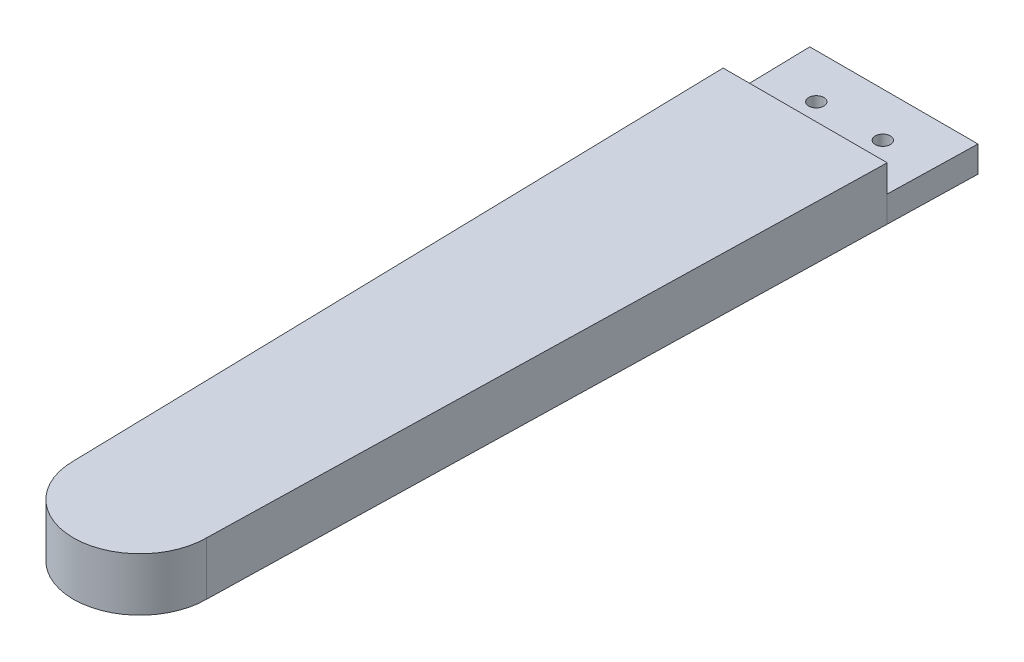
ISO-10303-21;
HEADER;
FILE_DESCRIPTION(('STEP AP214'),'2;1');
FILE_NAME('part.step','',(''),(''),'','','');
FILE_SCHEMA(('AUTOMOTIVE_DESIGN { 1 0 10303 214 1 1 1 1 }'));
ENDSEC;
DATA;
#1=APPLICATION_CONTEXT('core data for automotive mechanical design processes');
#2=APPLICATION_PROTOCOL_DEFINITION('international standard','automotive_design',2000,#1);
#3=PRODUCT_CONTEXT('',#1,'mechanical');
#4=PRODUCT('Part','Part','',(#3));
#5=PRODUCT_RELATED_PRODUCT_CATEGORY('part','',(#4));
#6=PRODUCT_DEFINITION_FORMATION('','',#4);
#7=PRODUCT_DEFINITION_CONTEXT('part definition',#1,'design');
#8=PRODUCT_DEFINITION('design','',#6,#7);
#9=PRODUCT_DEFINITION_SHAPE('','',#8);
#10=(LENGTH_UNIT() NAMED_UNIT(*) SI_UNIT(.MILLI.,.METRE.));
#11=(NAMED_UNIT(*) PLANE_ANGLE_UNIT() SI_UNIT($,.RADIAN.));
#12=(NAMED_UNIT(*) SI_UNIT($,.STERADIAN.) SOLID_ANGLE_UNIT());
#13=UNCERTAINTY_MEASURE_WITH_UNIT(LENGTH_MEASURE(1.E-05),#10,'distance_accuracy_value','');
#14=(GEOMETRIC_REPRESENTATION_CONTEXT(3) GLOBAL_UNCERTAINTY_ASSIGNED_CONTEXT((#13)) GLOBAL_UNIT_ASSIGNED_CONTEXT((#10,
#11,#12)) REPRESENTATION_CONTEXT('',''));
#15=CARTESIAN_POINT('',(0.,0.,0.));
#16=DIRECTION('',(0.,0.,1.));
#17=DIRECTION('',(1.,0.,0.));
#18=AXIS2_PLACEMENT_3D('',#15,#16,#17);
#19=CARTESIAN_POINT('',(7.5,5.9,-85.));
#20=DIRECTION('',(0.,-1.,0.));
#21=DIRECTION('',(0.,0.,-1.));
#22=AXIS2_PLACEMENT_3D('',#19,#20,#21);
#23=CYLINDRICAL_SURFACE('',#22,1.7);
#24=CARTESIAN_POINT('',(7.5,5.9,-85.));
#25=DIRECTION('',(0.,-1.,0.));
#26=DIRECTION('',(0.,0.,1.));
#27=AXIS2_PLACEMENT_3D('',#24,#25,#26);
#28=CIRCLE('',#27,1.7);
#29=CARTESIAN_POINT('',(7.5,5.9,-83.3));
#30=VERTEX_POINT('',#29);
#31=EDGE_CURVE('E277',#30,#30,#28,.T.);
#32=ORIENTED_EDGE('',*,*,#31,.F.);
#33=EDGE_LOOP('',(#32));
#34=FACE_BOUND('',#33,.T.);
#35=CARTESIAN_POINT('',(7.5,3.,-85.));
#36=DIRECTION('',(0.,-1.,0.));
#37=DIRECTION('',(0.,0.,-1.));
#38=AXIS2_PLACEMENT_3D('',#35,#36,#37);
#39=CIRCLE('',#38,1.7);
#40=CARTESIAN_POINT('',(7.5,3.,-86.7));
#41=VERTEX_POINT('',#40);
#42=EDGE_CURVE('E43',#41,#41,#39,.F.);
#43=ORIENTED_EDGE('',*,*,#42,.F.);
#44=EDGE_LOOP('',(#43));
#45=FACE_BOUND('',#44,.T.);
#46=ADVANCED_FACE('F39',(#34,#45),#23,.F.);
#47=CARTESIAN_POINT('',(-7.5,5.9,-85.));
#48=DIRECTION('',(0.,-1.,0.));
#49=DIRECTION('',(0.,0.,-1.));
#50=AXIS2_PLACEMENT_3D('',#47,#48,#49);
#51=CYLINDRICAL_SURFACE('',#50,1.7);
#52=CARTESIAN_POINT('',(-7.5,5.9,-85.));
#53=DIRECTION('',(0.,-1.,0.));
#54=DIRECTION('',(0.,0.,-1.));
#55=AXIS2_PLACEMENT_3D('',#52,#53,#54);
#56=CIRCLE('',#55,1.7);
#57=CARTESIAN_POINT('',(-7.5,5.9,-86.7));
#58=VERTEX_POINT('',#57);
#59=EDGE_CURVE('E273',#58,#58,#56,.T.);
#60=ORIENTED_EDGE('',*,*,#59,.F.);
#61=EDGE_LOOP('',(#60));
#62=FACE_BOUND('',#61,.T.);
#63=CARTESIAN_POINT('',(-7.5,3.,-85.));
#64=DIRECTION('',(0.,-1.,0.));
#65=DIRECTION('',(0.,0.,-1.));
#66=AXIS2_PLACEMENT_3D('',#63,#64,#65);
#67=CIRCLE('',#66,1.7);
#68=CARTESIAN_POINT('',(-7.5,3.,-86.7));
#69=VERTEX_POINT('',#68);
#70=EDGE_CURVE('E219',#69,#69,#67,.F.);
#71=ORIENTED_EDGE('',*,*,#70,.F.);
#72=EDGE_LOOP('',(#71));
#73=FACE_BOUND('',#72,.T.);
#74=ADVANCED_FACE('F339',(#62,#73),#51,.F.);
#75=CARTESIAN_POINT('',(0.,12.,75.));
#76=DIRECTION('',(0.,-1.,0.));
#77=DIRECTION('',(0.,0.,-1.));
#78=AXIS2_PLACEMENT_3D('',#75,#76,#77);
#79=CYLINDRICAL_SURFACE('',#78,15.);
#80=CARTESIAN_POINT('',(0.,0.,75.));
#81=DIRECTION('',(0.,1.,0.));
#82=DIRECTION('',(0.,0.,1.));
#83=AXIS2_PLACEMENT_3D('',#80,#81,#82);
#84=CIRCLE('',#83,15.);
#85=CARTESIAN_POINT('',(-15.,0.,75.));
#86=VERTEX_POINT('',#85);
#87=CARTESIAN_POINT('',(15.,0.,75.));
#88=VERTEX_POINT('',#87);
#89=EDGE_CURVE('E300',#86,#88,#84,.T.);
#90=ORIENTED_EDGE('',*,*,#89,.T.);
#91=DIRECTION('',(0.,-1.,0.));
#92=VECTOR('',#91,1.);
#93=CARTESIAN_POINT('',(15.,12.,75.));
#94=LINE('',#93,#92);
#95=CARTESIAN_POINT('',(15.,12.,75.));
#96=VERTEX_POINT('',#95);
#97=EDGE_CURVE('E11',#96,#88,#94,.T.);
#98=ORIENTED_EDGE('',*,*,#97,.F.);
#99=CARTESIAN_POINT('',(0.,12.,75.));
#100=DIRECTION('',(0.,1.,0.));
#101=DIRECTION('',(0.,0.,1.));
#102=AXIS2_PLACEMENT_3D('',#99,#100,#101);
#103=CIRCLE('',#102,15.);
#104=CARTESIAN_POINT('',(-15.,12.,75.));
#105=VERTEX_POINT('',#104);
#106=EDGE_CURVE('E308',#105,#96,#103,.T.);
#107=ORIENTED_EDGE('',*,*,#106,.F.);
#108=DIRECTION('',(0.,-1.,0.));
#109=VECTOR('',#108,1.);
#110=CARTESIAN_POINT('',(-15.,12.,75.));
#111=LINE('',#110,#109);
#112=EDGE_CURVE('E319',#105,#86,#111,.T.);
#113=ORIENTED_EDGE('',*,*,#112,.T.);
#114=EDGE_LOOP('',(#90,#98,#107,#113));
#115=FACE_BOUND('',#114,.T.);
#116=ADVANCED_FACE('F41',(#115),#79,.T.);
#117=CARTESIAN_POINT('',(16.7408855178847,12.,0.390620662083978));
#118=DIRECTION('',(0.999727888884777,0.,0.0233269840739782));
#119=DIRECTION('',(0.0233269840739782,0.,-0.999727888884777));
#120=AXIS2_PLACEMENT_3D('',#117,#118,#119);
#121=PLANE('',#120);
#122=DIRECTION('',(-0.0233269840739782,0.,0.999727888884777));
#123=VECTOR('',#122,1.);
#124=CARTESIAN_POINT('',(16.7408855178847,0.,0.390620662083978));
#125=LINE('',#124,#123);
#126=CARTESIAN_POINT('',(18.5,0.,-75.));
#127=VERTEX_POINT('',#126);
#128=EDGE_CURVE('E322',#127,#88,#125,.T.);
#129=ORIENTED_EDGE('',*,*,#128,.F.);
#130=DIRECTION('',(0.,-1.,0.));
#131=VECTOR('',#130,1.);
#132=CARTESIAN_POINT('',(18.5,5.9,-75.));
#133=LINE('',#132,#131);
#134=CARTESIAN_POINT('',(18.5,5.9,-75.));
#135=VERTEX_POINT('',#134);
#136=EDGE_CURVE('E297',#135,#127,#133,.T.);
#137=ORIENTED_EDGE('',*,*,#136,.F.);
#138=DIRECTION('',(0.,-1.,0.));
#139=VECTOR('',#138,1.);
#140=CARTESIAN_POINT('',(18.5,12.,-75.));
#141=LINE('',#140,#139);
#142=CARTESIAN_POINT('',(18.5,12.,-75.));
#143=VERTEX_POINT('',#142);
#144=EDGE_CURVE('E48',#143,#135,#141,.T.);
#145=ORIENTED_EDGE('',*,*,#144,.F.);
#146=DIRECTION('',(-0.0233269840739782,0.,0.999727888884777));
#147=VECTOR('',#146,1.);
#148=CARTESIAN_POINT('',(16.7408855178847,12.,0.390620662083978));
#149=LINE('',#148,#147);
#150=EDGE_CURVE('E310',#143,#96,#149,.T.);
#151=ORIENTED_EDGE('',*,*,#150,.T.);
#152=ORIENTED_EDGE('',*,*,#97,.T.);
#153=EDGE_LOOP('',(#129,#137,#145,#151,#152));
#154=FACE_BOUND('',#153,.T.);
#155=ADVANCED_FACE('F380',(#154),#121,.T.);
#156=CARTESIAN_POINT('',(0.,12.,-75.));
#157=DIRECTION('',(0.,0.,-1.));
#158=DIRECTION('',(-1.,0.,0.));
#159=AXIS2_PLACEMENT_3D('',#156,#157,#158);
#160=PLANE('',#159);
#161=DIRECTION('',(1.,0.,0.));
#162=VECTOR('',#161,1.);
#163=CARTESIAN_POINT('',(0.,5.9,-75.));
#164=LINE('',#163,#162);
#165=CARTESIAN_POINT('',(-18.5,5.9,-75.));
#166=VERTEX_POINT('',#165);
#167=EDGE_CURVE('E280',#166,#135,#164,.T.);
#168=ORIENTED_EDGE('',*,*,#167,.F.);
#169=DIRECTION('',(0.,-1.,0.));
#170=VECTOR('',#169,1.);
#171=CARTESIAN_POINT('',(-18.5,12.,-75.));
#172=LINE('',#171,#170);
#173=CARTESIAN_POINT('',(-18.5,12.,-75.));
#174=VERTEX_POINT('',#173);
#175=EDGE_CURVE('E328',#174,#166,#172,.T.);
#176=ORIENTED_EDGE('',*,*,#175,.F.);
#177=DIRECTION('',(1.,0.,0.));
#178=VECTOR('',#177,1.);
#179=CARTESIAN_POINT('',(0.,12.,-75.));
#180=LINE('',#179,#178);
#181=EDGE_CURVE('E314',#174,#143,#180,.T.);
#182=ORIENTED_EDGE('',*,*,#181,.T.);
#183=ORIENTED_EDGE('',*,*,#144,.T.);
#184=EDGE_LOOP('',(#168,#176,#182,#183));
#185=FACE_BOUND('',#184,.T.);
#186=ADVANCED_FACE('F377',(#185),#160,.T.);
#187=CARTESIAN_POINT('',(-16.7408855178847,12.,0.390620662083978));
#188=DIRECTION('',(0.999727888884777,0.,-0.0233269840739782));
#189=DIRECTION('',(-0.0233269840739782,0.,-0.999727888884777));
#190=AXIS2_PLACEMENT_3D('',#187,#188,#189);
#191=PLANE('',#190);
#192=DIRECTION('',(0.0233269840739782,0.,0.999727888884777));
#193=VECTOR('',#192,1.);
#194=CARTESIAN_POINT('',(-16.7408855178847,0.,0.390620662083978));
#195=LINE('',#194,#193);
#196=CARTESIAN_POINT('',(-18.5,0.,-75.));
#197=VERTEX_POINT('',#196);
#198=EDGE_CURVE('E311',#197,#86,#195,.T.);
#199=ORIENTED_EDGE('',*,*,#198,.T.);
#200=ORIENTED_EDGE('',*,*,#112,.F.);
#201=DIRECTION('',(0.0233269840739782,0.,0.999727888884777));
#202=VECTOR('',#201,1.);
#203=CARTESIAN_POINT('',(-16.7408855178847,12.,0.390620662083978));
#204=LINE('',#203,#202);
#205=EDGE_CURVE('E317',#174,#105,#204,.T.);
#206=ORIENTED_EDGE('',*,*,#205,.F.);
#207=ORIENTED_EDGE('',*,*,#175,.T.);
#208=DIRECTION('',(0.,-1.,0.));
#209=VECTOR('',#208,1.);
#210=CARTESIAN_POINT('',(-18.5,5.9,-75.));
#211=LINE('',#210,#209);
#212=EDGE_CURVE('E291',#166,#197,#211,.T.);
#213=ORIENTED_EDGE('',*,*,#212,.T.);
#214=EDGE_LOOP('',(#199,#200,#206,#207,#213));
#215=FACE_BOUND('',#214,.T.);
#216=ADVANCED_FACE('F370',(#215),#191,.F.);
#217=CARTESIAN_POINT('',(0.,12.,0.));
#218=DIRECTION('',(0.,1.,0.));
#219=DIRECTION('',(0.,0.,1.));
#220=AXIS2_PLACEMENT_3D('',#217,#218,#219);
#221=PLANE('',#220);
#222=ORIENTED_EDGE('',*,*,#106,.T.);
#223=ORIENTED_EDGE('',*,*,#150,.F.);
#224=ORIENTED_EDGE('',*,*,#181,.F.);
#225=ORIENTED_EDGE('',*,*,#205,.T.);
#226=EDGE_LOOP('',(#222,#223,#224,#225));
#227=FACE_BOUND('',#226,.T.);
#228=ADVANCED_FACE('F367',(#227),#221,.T.);
#229=CARTESIAN_POINT('',(0.,0.,0.));
#230=DIRECTION('',(0.,1.,0.));
#231=DIRECTION('',(0.,0.,1.));
#232=AXIS2_PLACEMENT_3D('',#229,#230,#231);
#233=PLANE('',#232);
#234=DIRECTION('',(-0.866025403784439,0.,-0.499999999999999));
#235=VECTOR('',#234,1.);
#236=CARTESIAN_POINT('',(-7.50000000000001,0.,-81.7668384925381));
#237=LINE('',#236,#235);
#238=CARTESIAN_POINT('',(-7.50000000000001,0.,-81.7668384925381));
#239=VERTEX_POINT('',#238);
#240=CARTESIAN_POINT('',(-10.3,0.,-83.3834192462691));
#241=VERTEX_POINT('',#240);
#242=EDGE_CURVE('E207',#239,#241,#237,.T.);
#243=ORIENTED_EDGE('',*,*,#242,.F.);
#244=DIRECTION('',(-0.866025403784439,0.,0.5));
#245=VECTOR('',#244,1.);
#246=CARTESIAN_POINT('',(-4.70000000000002,0.,-83.3834192462691));
#247=LINE('',#246,#245);
#248=CARTESIAN_POINT('',(-4.70000000000002,0.,-83.3834192462691));
#249=VERTEX_POINT('',#248);
#250=EDGE_CURVE('E56',#249,#239,#247,.T.);
#251=ORIENTED_EDGE('',*,*,#250,.F.);
#252=DIRECTION('',(0.,0.,1.));
#253=VECTOR('',#252,1.);
#254=CARTESIAN_POINT('',(-4.70000000000002,0.,-86.616580753731));
#255=LINE('',#254,#253);
#256=CARTESIAN_POINT('',(-4.70000000000002,0.,-86.616580753731));
#257=VERTEX_POINT('',#256);
#258=EDGE_CURVE('E193',#257,#249,#255,.T.);
#259=ORIENTED_EDGE('',*,*,#258,.F.);
#260=DIRECTION('',(0.866025403784439,0.,0.5));
#261=VECTOR('',#260,1.);
#262=CARTESIAN_POINT('',(-7.50000000000004,0.,-88.2331615074619));
#263=LINE('',#262,#261);
#264=CARTESIAN_POINT('',(-7.50000000000004,0.,-88.2331615074619));
#265=VERTEX_POINT('',#264);
#266=EDGE_CURVE('E196',#265,#257,#263,.T.);
#267=ORIENTED_EDGE('',*,*,#266,.F.);
#268=DIRECTION('',(0.866025403784439,0.,-0.499999999999999));
#269=VECTOR('',#268,1.);
#270=CARTESIAN_POINT('',(-10.3,0.,-86.616580753731));
#271=LINE('',#270,#269);
#272=CARTESIAN_POINT('',(-10.3,0.,-86.616580753731));
#273=VERTEX_POINT('',#272);
#274=EDGE_CURVE('E212',#273,#265,#271,.T.);
#275=ORIENTED_EDGE('',*,*,#274,.F.);
#276=DIRECTION('',(0.,0.,-1.));
#277=VECTOR('',#276,1.);
#278=CARTESIAN_POINT('',(-10.3,0.,-83.3834192462691));
#279=LINE('',#278,#277);
#280=EDGE_CURVE('E209',#241,#273,#279,.T.);
#281=ORIENTED_EDGE('',*,*,#280,.F.);
#282=EDGE_LOOP('',(#243,#251,#259,#267,#275,#281));
#283=FACE_BOUND('',#282,.T.);
#284=DIRECTION('',(-0.866025403784438,0.,-0.500000000000001));
#285=VECTOR('',#284,1.);
#286=CARTESIAN_POINT('',(7.5,0.,-81.7668384925381));
#287=LINE('',#286,#285);
#288=CARTESIAN_POINT('',(7.5,0.,-81.7668384925381));
#289=VERTEX_POINT('',#288);
#290=CARTESIAN_POINT('',(4.7,0.,-83.3834192462691));
#291=VERTEX_POINT('',#290);
#292=EDGE_CURVE('E253',#289,#291,#287,.T.);
#293=ORIENTED_EDGE('',*,*,#292,.F.);
#294=DIRECTION('',(-0.866025403784442,0.,0.499999999999995));
#295=VECTOR('',#294,1.);
#296=CARTESIAN_POINT('',(10.3,0.,-83.383419246269));
#297=LINE('',#296,#295);
#298=CARTESIAN_POINT('',(10.3,0.,-83.383419246269));
#299=VERTEX_POINT('',#298);
#300=EDGE_CURVE('E64',#299,#289,#297,.T.);
#301=ORIENTED_EDGE('',*,*,#300,.F.);
#302=DIRECTION('',(0.,0.,1.));
#303=VECTOR('',#302,1.);
#304=CARTESIAN_POINT('',(10.3,0.,-86.616580753731));
#305=LINE('',#304,#303);
#306=CARTESIAN_POINT('',(10.3,0.,-86.616580753731));
#307=VERTEX_POINT('',#306);
#308=EDGE_CURVE('E240',#307,#299,#305,.T.);
#309=ORIENTED_EDGE('',*,*,#308,.F.);
#310=DIRECTION('',(0.866025403784435,0.,0.500000000000006));
#311=VECTOR('',#310,1.);
#312=CARTESIAN_POINT('',(7.50000000000002,0.,-88.2331615074619));
#313=LINE('',#312,#311);
#314=CARTESIAN_POINT('',(7.50000000000002,0.,-88.2331615074619));
#315=VERTEX_POINT('',#314);
#316=EDGE_CURVE('E243',#315,#307,#313,.T.);
#317=ORIENTED_EDGE('',*,*,#316,.F.);
#318=DIRECTION('',(0.866025403784441,0.,-0.499999999999996));
#319=VECTOR('',#318,1.);
#320=CARTESIAN_POINT('',(4.70000000000001,0.,-86.616580753731));
#321=LINE('',#320,#319);
#322=CARTESIAN_POINT('',(4.70000000000001,0.,-86.616580753731));
#323=VERTEX_POINT('',#322);
#324=EDGE_CURVE('E247',#323,#315,#321,.T.);
#325=ORIENTED_EDGE('',*,*,#324,.F.);
#326=DIRECTION('',(0.,0.,-1.));
#327=VECTOR('',#326,1.);
#328=CARTESIAN_POINT('',(4.7,0.,-83.3834192462691));
#329=LINE('',#328,#327);
#330=EDGE_CURVE('E250',#291,#323,#329,.T.);
#331=ORIENTED_EDGE('',*,*,#330,.F.);
#332=EDGE_LOOP('',(#293,#301,#309,#317,#325,#331));
#333=FACE_BOUND('',#332,.T.);
#334=ORIENTED_EDGE('',*,*,#89,.F.);
#335=ORIENTED_EDGE('',*,*,#198,.F.);
#336=DIRECTION('',(0.0232437185074771,0.,0.999729828278593));
#337=VECTOR('',#336,1.);
#338=CARTESIAN_POINT('',(-16.7471970932713,0.,0.389372332418554));
#339=LINE('',#338,#337);
#340=CARTESIAN_POINT('',(-18.965,0.,-95.));
#341=VERTEX_POINT('',#340);
#342=EDGE_CURVE('E276',#341,#197,#339,.T.);
#343=ORIENTED_EDGE('',*,*,#342,.F.);
#344=DIRECTION('',(-1.,0.,0.));
#345=VECTOR('',#344,1.);
#346=CARTESIAN_POINT('',(0.,0.,-95.));
#347=LINE('',#346,#345);
#348=CARTESIAN_POINT('',(18.965,0.,-95.));
#349=VERTEX_POINT('',#348);
#350=EDGE_CURVE('E294',#349,#341,#347,.T.);
#351=ORIENTED_EDGE('',*,*,#350,.F.);
#352=DIRECTION('',(0.0232437185074775,0.,-0.999729828278593));
#353=VECTOR('',#352,1.);
#354=CARTESIAN_POINT('',(16.7471970932713,0.,0.38937233241856));
#355=LINE('',#354,#353);
#356=EDGE_CURVE('E284',#127,#349,#355,.T.);
#357=ORIENTED_EDGE('',*,*,#356,.F.);
#358=ORIENTED_EDGE('',*,*,#128,.T.);
#359=EDGE_LOOP('',(#334,#335,#343,#351,#357,#358));
#360=FACE_BOUND('',#359,.T.);
#361=ADVANCED_FACE('F359',(#283,#333,#360),#233,.F.);
#362=CARTESIAN_POINT('',(16.7471970932713,5.9,0.38937233241856));
#363=DIRECTION('',(-0.999729828278593,0.,-0.0232437185074775));
#364=DIRECTION('',(-0.0232437185074775,0.,0.999729828278593));
#365=AXIS2_PLACEMENT_3D('',#362,#363,#364);
#366=PLANE('',#365);
#367=ORIENTED_EDGE('',*,*,#356,.T.);
#368=DIRECTION('',(0.,-1.,0.));
#369=VECTOR('',#368,1.);
#370=CARTESIAN_POINT('',(18.965,5.9,-95.));
#371=LINE('',#370,#369);
#372=CARTESIAN_POINT('',(18.965,5.9,-95.));
#373=VERTEX_POINT('',#372);
#374=EDGE_CURVE('E301',#373,#349,#371,.T.);
#375=ORIENTED_EDGE('',*,*,#374,.F.);
#376=DIRECTION('',(0.0232437185074775,0.,-0.999729828278593));
#377=VECTOR('',#376,1.);
#378=CARTESIAN_POINT('',(16.7471970932713,5.9,0.38937233241856));
#379=LINE('',#378,#377);
#380=EDGE_CURVE('E289',#135,#373,#379,.T.);
#381=ORIENTED_EDGE('',*,*,#380,.F.);
#382=ORIENTED_EDGE('',*,*,#136,.T.);
#383=EDGE_LOOP('',(#367,#375,#381,#382));
#384=FACE_BOUND('',#383,.T.);
#385=ADVANCED_FACE('F355',(#384),#366,.F.);
#386=CARTESIAN_POINT('',(0.,5.9,-95.));
#387=DIRECTION('',(0.,0.,1.));
#388=DIRECTION('',(1.,0.,0.));
#389=AXIS2_PLACEMENT_3D('',#386,#387,#388);
#390=PLANE('',#389);
#391=ORIENTED_EDGE('',*,*,#350,.T.);
#392=DIRECTION('',(0.,-1.,0.));
#393=VECTOR('',#392,1.);
#394=CARTESIAN_POINT('',(-18.965,5.9,-95.));
#395=LINE('',#394,#393);
#396=CARTESIAN_POINT('',(-18.965,5.9,-95.));
#397=VERTEX_POINT('',#396);
#398=EDGE_CURVE('E304',#397,#341,#395,.T.);
#399=ORIENTED_EDGE('',*,*,#398,.F.);
#400=DIRECTION('',(-1.,0.,0.));
#401=VECTOR('',#400,1.);
#402=CARTESIAN_POINT('',(0.,5.9,-95.));
#403=LINE('',#402,#401);
#404=EDGE_CURVE('E287',#373,#397,#403,.T.);
#405=ORIENTED_EDGE('',*,*,#404,.F.);
#406=ORIENTED_EDGE('',*,*,#374,.T.);
#407=EDGE_LOOP('',(#391,#399,#405,#406));
#408=FACE_BOUND('',#407,.T.);
#409=ADVANCED_FACE('F358',(#408),#390,.F.);
#410=CARTESIAN_POINT('',(-16.7471970932713,5.9,0.389372332418554));
#411=DIRECTION('',(0.999729828278593,0.,-0.0232437185074771));
#412=DIRECTION('',(-0.0232437185074771,0.,-0.999729828278593));
#413=AXIS2_PLACEMENT_3D('',#410,#411,#412);
#414=PLANE('',#413);
#415=ORIENTED_EDGE('',*,*,#342,.T.);
#416=ORIENTED_EDGE('',*,*,#212,.F.);
#417=DIRECTION('',(0.0232437185074771,0.,0.999729828278593));
#418=VECTOR('',#417,1.);
#419=CARTESIAN_POINT('',(-16.7471970932713,5.9,0.389372332418554));
#420=LINE('',#419,#418);
#421=EDGE_CURVE('E283',#397,#166,#420,.T.);
#422=ORIENTED_EDGE('',*,*,#421,.F.);
#423=ORIENTED_EDGE('',*,*,#398,.T.);
#424=EDGE_LOOP('',(#415,#416,#422,#423));
#425=FACE_BOUND('',#424,.T.);
#426=ADVANCED_FACE('F353',(#425),#414,.F.);
#427=CARTESIAN_POINT('',(0.,5.9,0.));
#428=DIRECTION('',(0.,-1.,0.));
#429=DIRECTION('',(0.,0.,-1.));
#430=AXIS2_PLACEMENT_3D('',#427,#428,#429);
#431=PLANE('',#430);
#432=ORIENTED_EDGE('',*,*,#59,.T.);
#433=EDGE_LOOP('',(#432));
#434=FACE_BOUND('',#433,.T.);
#435=ORIENTED_EDGE('',*,*,#31,.T.);
#436=EDGE_LOOP('',(#435));
#437=FACE_BOUND('',#436,.T.);
#438=ORIENTED_EDGE('',*,*,#167,.T.);
#439=ORIENTED_EDGE('',*,*,#380,.T.);
#440=ORIENTED_EDGE('',*,*,#404,.T.);
#441=ORIENTED_EDGE('',*,*,#421,.T.);
#442=EDGE_LOOP('',(#438,#439,#440,#441));
#443=FACE_BOUND('',#442,.T.);
#444=ADVANCED_FACE('F350',(#434,#437,#443),#431,.F.);
#445=CARTESIAN_POINT('',(0.,3.,0.));
#446=DIRECTION('',(0.,-1.,0.));
#447=DIRECTION('',(0.,0.,-1.));
#448=AXIS2_PLACEMENT_3D('',#445,#446,#447);
#449=PLANE('',#448);
#450=DIRECTION('',(-0.866025403784439,0.,0.5));
#451=VECTOR('',#450,1.);
#452=CARTESIAN_POINT('',(-4.70000000000002,3.,-83.3834192462691));
#453=LINE('',#452,#451);
#454=CARTESIAN_POINT('',(-4.70000000000002,3.,-83.3834192462691));
#455=VERTEX_POINT('',#454);
#456=CARTESIAN_POINT('',(-7.50000000000001,3.,-81.7668384925381));
#457=VERTEX_POINT('',#456);
#458=EDGE_CURVE('E173',#455,#457,#453,.T.);
#459=ORIENTED_EDGE('',*,*,#458,.T.);
#460=DIRECTION('',(-0.866025403784439,0.,-0.499999999999999));
#461=VECTOR('',#460,1.);
#462=CARTESIAN_POINT('',(-7.50000000000001,3.,-81.7668384925381));
#463=LINE('',#462,#461);
#464=CARTESIAN_POINT('',(-10.3,3.,-83.3834192462691));
#465=VERTEX_POINT('',#464);
#466=EDGE_CURVE('E182',#457,#465,#463,.T.);
#467=ORIENTED_EDGE('',*,*,#466,.T.);
#468=DIRECTION('',(0.,0.,-1.));
#469=VECTOR('',#468,1.);
#470=CARTESIAN_POINT('',(-10.3,3.,-83.3834192462691));
#471=LINE('',#470,#469);
#472=CARTESIAN_POINT('',(-10.3,3.,-86.616580753731));
#473=VERTEX_POINT('',#472);
#474=EDGE_CURVE('E187',#465,#473,#471,.T.);
#475=ORIENTED_EDGE('',*,*,#474,.T.);
#476=DIRECTION('',(0.866025403784439,0.,-0.499999999999999));
#477=VECTOR('',#476,1.);
#478=CARTESIAN_POINT('',(-10.3,3.,-86.616580753731));
#479=LINE('',#478,#477);
#480=CARTESIAN_POINT('',(-7.50000000000004,3.,-88.2331615074619));
#481=VERTEX_POINT('',#480);
#482=EDGE_CURVE('E200',#473,#481,#479,.T.);
#483=ORIENTED_EDGE('',*,*,#482,.T.);
#484=DIRECTION('',(0.866025403784439,0.,0.5));
#485=VECTOR('',#484,1.);
#486=CARTESIAN_POINT('',(-7.50000000000004,3.,-88.2331615074619));
#487=LINE('',#486,#485);
#488=CARTESIAN_POINT('',(-4.70000000000002,3.,-86.616580753731));
#489=VERTEX_POINT('',#488);
#490=EDGE_CURVE('E203',#481,#489,#487,.T.);
#491=ORIENTED_EDGE('',*,*,#490,.T.);
#492=DIRECTION('',(0.,0.,1.));
#493=VECTOR('',#492,1.);
#494=CARTESIAN_POINT('',(-4.70000000000002,3.,-86.616580753731));
#495=LINE('',#494,#493);
#496=EDGE_CURVE('E179',#489,#455,#495,.T.);
#497=ORIENTED_EDGE('',*,*,#496,.T.);
#498=EDGE_LOOP('',(#459,#467,#475,#483,#491,#497));
#499=FACE_BOUND('',#498,.T.);
#500=ORIENTED_EDGE('',*,*,#70,.T.);
#501=EDGE_LOOP('',(#500));
#502=FACE_BOUND('',#501,.T.);
#503=ADVANCED_FACE('F189',(#499,#502),#449,.T.);
#504=CARTESIAN_POINT('',(-4.70000000000002,3.,-83.3834192462691));
#505=DIRECTION('',(0.5,0.,0.866025403784439));
#506=DIRECTION('',(0.866025403784439,0.,-0.5));
#507=AXIS2_PLACEMENT_3D('',#504,#505,#506);
#508=PLANE('',#507);
#509=ORIENTED_EDGE('',*,*,#250,.T.);
#510=DIRECTION('',(0.,-1.,0.));
#511=VECTOR('',#510,1.);
#512=CARTESIAN_POINT('',(-7.50000000000001,3.,-81.7668384925381));
#513=LINE('',#512,#511);
#514=EDGE_CURVE('E169',#457,#239,#513,.T.);
#515=ORIENTED_EDGE('',*,*,#514,.F.);
#516=ORIENTED_EDGE('',*,*,#458,.F.);
#517=DIRECTION('',(0.,-1.,0.));
#518=VECTOR('',#517,1.);
#519=CARTESIAN_POINT('',(-4.70000000000002,3.,-83.3834192462691));
#520=LINE('',#519,#518);
#521=EDGE_CURVE('E217',#455,#249,#520,.T.);
#522=ORIENTED_EDGE('',*,*,#521,.T.);
#523=EDGE_LOOP('',(#509,#515,#516,#522));
#524=FACE_BOUND('',#523,.T.);
#525=ADVANCED_FACE('F171',(#524),#508,.F.);
#526=CARTESIAN_POINT('',(-4.70000000000002,3.,-86.616580753731));
#527=DIRECTION('',(1.,0.,0.));
#528=DIRECTION('',(0.,0.,-1.));
#529=AXIS2_PLACEMENT_3D('',#526,#527,#528);
#530=PLANE('',#529);
#531=ORIENTED_EDGE('',*,*,#258,.T.);
#532=ORIENTED_EDGE('',*,*,#521,.F.);
#533=ORIENTED_EDGE('',*,*,#496,.F.);
#534=DIRECTION('',(0.,-1.,0.));
#535=VECTOR('',#534,1.);
#536=CARTESIAN_POINT('',(-4.70000000000002,3.,-86.616580753731));
#537=LINE('',#536,#535);
#538=EDGE_CURVE('E220',#489,#257,#537,.T.);
#539=ORIENTED_EDGE('',*,*,#538,.T.);
#540=EDGE_LOOP('',(#531,#532,#533,#539));
#541=FACE_BOUND('',#540,.T.);
#542=ADVANCED_FACE('F446',(#541),#530,.F.);
#543=CARTESIAN_POINT('',(-7.50000000000004,3.,-88.2331615074619));
#544=DIRECTION('',(0.5,0.,-0.866025403784439));
#545=DIRECTION('',(-0.866025403784439,0.,-0.5));
#546=AXIS2_PLACEMENT_3D('',#543,#544,#545);
#547=PLANE('',#546);
#548=ORIENTED_EDGE('',*,*,#266,.T.);
#549=ORIENTED_EDGE('',*,*,#538,.F.);
#550=ORIENTED_EDGE('',*,*,#490,.F.);
#551=DIRECTION('',(0.,-1.,0.));
#552=VECTOR('',#551,1.);
#553=CARTESIAN_POINT('',(-7.50000000000004,3.,-88.2331615074619));
#554=LINE('',#553,#552);
#555=EDGE_CURVE('E222',#481,#265,#554,.T.);
#556=ORIENTED_EDGE('',*,*,#555,.T.);
#557=EDGE_LOOP('',(#548,#549,#550,#556));
#558=FACE_BOUND('',#557,.T.);
#559=ADVANCED_FACE('F456',(#558),#547,.F.);
#560=CARTESIAN_POINT('',(-10.3,3.,-86.616580753731));
#561=DIRECTION('',(-0.499999999999999,0.,-0.866025403784439));
#562=DIRECTION('',(-0.866025403784439,0.,0.5));
#563=AXIS2_PLACEMENT_3D('',#560,#561,#562);
#564=PLANE('',#563);
#565=ORIENTED_EDGE('',*,*,#274,.T.);
#566=ORIENTED_EDGE('',*,*,#555,.F.);
#567=ORIENTED_EDGE('',*,*,#482,.F.);
#568=DIRECTION('',(0.,-1.,0.));
#569=VECTOR('',#568,1.);
#570=CARTESIAN_POINT('',(-10.3,3.,-86.616580753731));
#571=LINE('',#570,#569);
#572=EDGE_CURVE('E224',#473,#273,#571,.T.);
#573=ORIENTED_EDGE('',*,*,#572,.T.);
#574=EDGE_LOOP('',(#565,#566,#567,#573));
#575=FACE_BOUND('',#574,.T.);
#576=ADVANCED_FACE('F467',(#575),#564,.F.);
#577=CARTESIAN_POINT('',(-10.3,3.,-83.3834192462691));
#578=DIRECTION('',(-1.,0.,0.));
#579=DIRECTION('',(0.,0.,1.));
#580=AXIS2_PLACEMENT_3D('',#577,#578,#579);
#581=PLANE('',#580);
#582=ORIENTED_EDGE('',*,*,#280,.T.);
#583=ORIENTED_EDGE('',*,*,#572,.F.);
#584=ORIENTED_EDGE('',*,*,#474,.F.);
#585=DIRECTION('',(0.,-1.,0.));
#586=VECTOR('',#585,1.);
#587=CARTESIAN_POINT('',(-10.3,3.,-83.3834192462691));
#588=LINE('',#587,#586);
#589=EDGE_CURVE('E178',#465,#241,#588,.T.);
#590=ORIENTED_EDGE('',*,*,#589,.T.);
#591=EDGE_LOOP('',(#582,#583,#584,#590));
#592=FACE_BOUND('',#591,.T.);
#593=ADVANCED_FACE('F478',(#592),#581,.F.);
#594=CARTESIAN_POINT('',(-7.50000000000001,3.,-81.7668384925381));
#595=DIRECTION('',(-0.5,0.,0.866025403784439));
#596=DIRECTION('',(0.866025403784439,0.,0.5));
#597=AXIS2_PLACEMENT_3D('',#594,#595,#596);
#598=PLANE('',#597);
#599=ORIENTED_EDGE('',*,*,#242,.T.);
#600=ORIENTED_EDGE('',*,*,#589,.F.);
#601=ORIENTED_EDGE('',*,*,#466,.F.);
#602=ORIENTED_EDGE('',*,*,#514,.T.);
#603=EDGE_LOOP('',(#599,#600,#601,#602));
#604=FACE_BOUND('',#603,.T.);
#605=ADVANCED_FACE('F183',(#604),#598,.F.);
#606=CARTESIAN_POINT('',(0.,3.,0.));
#607=DIRECTION('',(0.,-1.,0.));
#608=DIRECTION('',(0.,0.,-1.));
#609=AXIS2_PLACEMENT_3D('',#606,#607,#608);
#610=PLANE('',#609);
#611=DIRECTION('',(-0.866025403784442,0.,0.499999999999995));
#612=VECTOR('',#611,1.);
#613=CARTESIAN_POINT('',(10.3,3.,-83.383419246269));
#614=LINE('',#613,#612);
#615=CARTESIAN_POINT('',(10.3,3.,-83.383419246269));
#616=VERTEX_POINT('',#615);
#617=CARTESIAN_POINT('',(7.5,3.,-81.7668384925381));
#618=VERTEX_POINT('',#617);
#619=EDGE_CURVE('E244',#616,#618,#614,.T.);
#620=ORIENTED_EDGE('',*,*,#619,.T.);
#621=DIRECTION('',(-0.866025403784438,0.,-0.500000000000001));
#622=VECTOR('',#621,1.);
#623=CARTESIAN_POINT('',(7.5,3.,-81.7668384925381));
#624=LINE('',#623,#622);
#625=CARTESIAN_POINT('',(4.7,3.,-83.3834192462691));
#626=VERTEX_POINT('',#625);
#627=EDGE_CURVE('E268',#618,#626,#624,.T.);
#628=ORIENTED_EDGE('',*,*,#627,.T.);
#629=DIRECTION('',(0.,0.,-1.));
#630=VECTOR('',#629,1.);
#631=CARTESIAN_POINT('',(4.7,3.,-83.3834192462691));
#632=LINE('',#631,#630);
#633=CARTESIAN_POINT('',(4.70000000000001,3.,-86.616580753731));
#634=VERTEX_POINT('',#633);
#635=EDGE_CURVE('E265',#626,#634,#632,.T.);
#636=ORIENTED_EDGE('',*,*,#635,.T.);
#637=DIRECTION('',(0.866025403784441,0.,-0.499999999999996));
#638=VECTOR('',#637,1.);
#639=CARTESIAN_POINT('',(4.70000000000001,3.,-86.616580753731));
#640=LINE('',#639,#638);
#641=CARTESIAN_POINT('',(7.50000000000002,3.,-88.2331615074619));
#642=VERTEX_POINT('',#641);
#643=EDGE_CURVE('E262',#634,#642,#640,.T.);
#644=ORIENTED_EDGE('',*,*,#643,.T.);
#645=DIRECTION('',(0.866025403784435,0.,0.500000000000006));
#646=VECTOR('',#645,1.);
#647=CARTESIAN_POINT('',(7.50000000000002,3.,-88.2331615074619));
#648=LINE('',#647,#646);
#649=CARTESIAN_POINT('',(10.3,3.,-86.616580753731));
#650=VERTEX_POINT('',#649);
#651=EDGE_CURVE('E259',#642,#650,#648,.T.);
#652=ORIENTED_EDGE('',*,*,#651,.T.);
#653=DIRECTION('',(0.,0.,1.));
#654=VECTOR('',#653,1.);
#655=CARTESIAN_POINT('',(10.3,3.,-86.616580753731));
#656=LINE('',#655,#654);
#657=EDGE_CURVE('E229',#650,#616,#656,.T.);
#658=ORIENTED_EDGE('',*,*,#657,.T.);
#659=EDGE_LOOP('',(#620,#628,#636,#644,#652,#658));
#660=FACE_BOUND('',#659,.T.);
#661=ORIENTED_EDGE('',*,*,#42,.T.);
#662=EDGE_LOOP('',(#661));
#663=FACE_BOUND('',#662,.T.);
#664=ADVANCED_FACE('F336',(#660,#663),#610,.T.);
#665=CARTESIAN_POINT('',(10.3,3.,-83.383419246269));
#666=DIRECTION('',(0.499999999999995,0.,0.866025403784442));
#667=DIRECTION('',(0.866025403784442,0.,-0.499999999999995));
#668=AXIS2_PLACEMENT_3D('',#665,#666,#667);
#669=PLANE('',#668);
#670=ORIENTED_EDGE('',*,*,#300,.T.);
#671=DIRECTION('',(0.,-1.,0.));
#672=VECTOR('',#671,1.);
#673=CARTESIAN_POINT('',(7.5,3.,-81.7668384925381));
#674=LINE('',#673,#672);
#675=EDGE_CURVE('E227',#618,#289,#674,.T.);
#676=ORIENTED_EDGE('',*,*,#675,.F.);
#677=ORIENTED_EDGE('',*,*,#619,.F.);
#678=DIRECTION('',(0.,-1.,0.));
#679=VECTOR('',#678,1.);
#680=CARTESIAN_POINT('',(10.3,3.,-83.383419246269));
#681=LINE('',#680,#679);
#682=EDGE_CURVE('E238',#616,#299,#681,.T.);
#683=ORIENTED_EDGE('',*,*,#682,.T.);
#684=EDGE_LOOP('',(#670,#676,#677,#683));
#685=FACE_BOUND('',#684,.T.);
#686=ADVANCED_FACE('F508',(#685),#669,.F.);
#687=CARTESIAN_POINT('',(10.3,3.,-86.616580753731));
#688=DIRECTION('',(1.,0.,0.));
#689=DIRECTION('',(0.,0.,-1.));
#690=AXIS2_PLACEMENT_3D('',#687,#688,#689);
#691=PLANE('',#690);
#692=ORIENTED_EDGE('',*,*,#308,.T.);
#693=ORIENTED_EDGE('',*,*,#682,.F.);
#694=ORIENTED_EDGE('',*,*,#657,.F.);
#695=DIRECTION('',(0.,-1.,0.));
#696=VECTOR('',#695,1.);
#697=CARTESIAN_POINT('',(10.3,3.,-86.616580753731));
#698=LINE('',#697,#696);
#699=EDGE_CURVE('E236',#650,#307,#698,.T.);
#700=ORIENTED_EDGE('',*,*,#699,.T.);
#701=EDGE_LOOP('',(#692,#693,#694,#700));
#702=FACE_BOUND('',#701,.T.);
#703=ADVANCED_FACE('F518',(#702),#691,.F.);
#704=CARTESIAN_POINT('',(7.50000000000002,3.,-88.2331615074619));
#705=DIRECTION('',(0.500000000000006,0.,-0.866025403784435));
#706=DIRECTION('',(-0.866025403784435,0.,-0.500000000000006));
#707=AXIS2_PLACEMENT_3D('',#704,#705,#706);
#708=PLANE('',#707);
#709=ORIENTED_EDGE('',*,*,#316,.T.);
#710=ORIENTED_EDGE('',*,*,#699,.F.);
#711=ORIENTED_EDGE('',*,*,#651,.F.);
#712=DIRECTION('',(0.,-1.,0.));
#713=VECTOR('',#712,1.);
#714=CARTESIAN_POINT('',(7.50000000000002,3.,-88.2331615074619));
#715=LINE('',#714,#713);
#716=EDGE_CURVE('E234',#642,#315,#715,.T.);
#717=ORIENTED_EDGE('',*,*,#716,.T.);
#718=EDGE_LOOP('',(#709,#710,#711,#717));
#719=FACE_BOUND('',#718,.T.);
#720=ADVANCED_FACE('F528',(#719),#708,.F.);
#721=CARTESIAN_POINT('',(4.70000000000001,3.,-86.616580753731));
#722=DIRECTION('',(-0.499999999999996,0.,-0.866025403784441));
#723=DIRECTION('',(-0.866025403784441,0.,0.499999999999996));
#724=AXIS2_PLACEMENT_3D('',#721,#722,#723);
#725=PLANE('',#724);
#726=ORIENTED_EDGE('',*,*,#324,.T.);
#727=ORIENTED_EDGE('',*,*,#716,.F.);
#728=ORIENTED_EDGE('',*,*,#643,.F.);
#729=DIRECTION('',(0.,-1.,0.));
#730=VECTOR('',#729,1.);
#731=CARTESIAN_POINT('',(4.70000000000001,3.,-86.616580753731));
#732=LINE('',#731,#730);
#733=EDGE_CURVE('E232',#634,#323,#732,.T.);
#734=ORIENTED_EDGE('',*,*,#733,.T.);
#735=EDGE_LOOP('',(#726,#727,#728,#734));
#736=FACE_BOUND('',#735,.T.);
#737=ADVANCED_FACE('F539',(#736),#725,.F.);
#738=CARTESIAN_POINT('',(4.7,3.,-83.3834192462691));
#739=DIRECTION('',(-1.,0.,0.));
#740=DIRECTION('',(0.,0.,1.));
#741=AXIS2_PLACEMENT_3D('',#738,#739,#740);
#742=PLANE('',#741);
#743=ORIENTED_EDGE('',*,*,#330,.T.);
#744=ORIENTED_EDGE('',*,*,#733,.F.);
#745=ORIENTED_EDGE('',*,*,#635,.F.);
#746=DIRECTION('',(0.,-1.,0.));
#747=VECTOR('',#746,1.);
#748=CARTESIAN_POINT('',(4.7,3.,-83.3834192462691));
#749=LINE('',#748,#747);
#750=EDGE_CURVE('E230',#626,#291,#749,.T.);
#751=ORIENTED_EDGE('',*,*,#750,.T.);
#752=EDGE_LOOP('',(#743,#744,#745,#751));
#753=FACE_BOUND('',#752,.T.);
#754=ADVANCED_FACE('F550',(#753),#742,.F.);
#755=CARTESIAN_POINT('',(7.5,3.,-81.7668384925381));
#756=DIRECTION('',(-0.500000000000001,0.,0.866025403784438));
#757=DIRECTION('',(0.866025403784438,0.,0.500000000000001));
#758=AXIS2_PLACEMENT_3D('',#755,#756,#757);
#759=PLANE('',#758);
#760=ORIENTED_EDGE('',*,*,#292,.T.);
#761=ORIENTED_EDGE('',*,*,#750,.F.);
#762=ORIENTED_EDGE('',*,*,#627,.F.);
#763=ORIENTED_EDGE('',*,*,#675,.T.);
#764=EDGE_LOOP('',(#760,#761,#762,#763));
#765=FACE_BOUND('',#764,.T.);
#766=ADVANCED_FACE('F561',(#765),#759,.F.);
#767=CLOSED_SHELL('',(#46,#74,#116,#155,#186,#216,#228,#361,#385,#409,#426,#444,#503,#525,#542,
#559,#576,#593,#605,#664,#686,#703,#720,#737,#754,#766));
#768=MANIFOLD_SOLID_BREP('B2',#767);
#769=ADVANCED_BREP_SHAPE_REPRESENTATION('',(#18,#768),#14);
#770=SHAPE_DEFINITION_REPRESENTATION(#9,#769);
ENDSEC;
END-ISO-10303-21;
